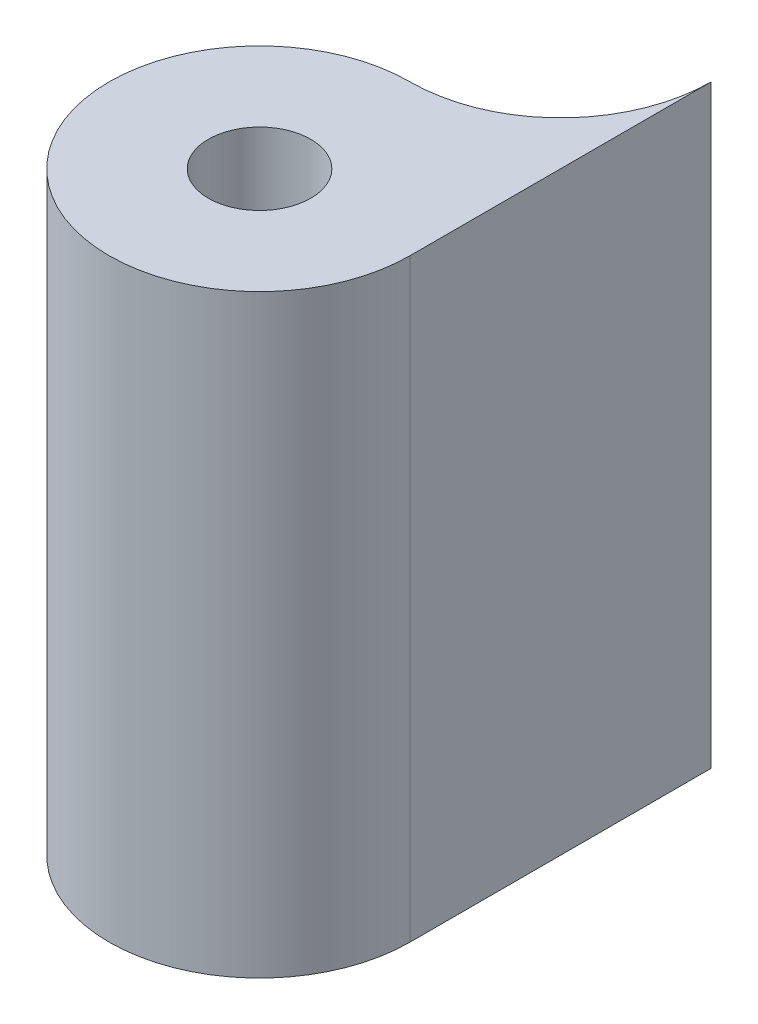
ISO-10303-21;
HEADER;
FILE_DESCRIPTION(('STEP AP214'),'2;1');
FILE_NAME('part.step','',(''),(''),'','','');
FILE_SCHEMA(('AUTOMOTIVE_DESIGN { 1 0 10303 214 1 1 1 1 }'));
ENDSEC;
DATA;
#1=APPLICATION_CONTEXT('core data for automotive mechanical design processes');
#2=APPLICATION_PROTOCOL_DEFINITION('international standard','automotive_design',2000,#1);
#3=PRODUCT_CONTEXT('',#1,'mechanical');
#4=PRODUCT('Part','Part','',(#3));
#5=PRODUCT_RELATED_PRODUCT_CATEGORY('part','',(#4));
#6=PRODUCT_DEFINITION_FORMATION('','',#4);
#7=PRODUCT_DEFINITION_CONTEXT('part definition',#1,'design');
#8=PRODUCT_DEFINITION('design','',#6,#7);
#9=PRODUCT_DEFINITION_SHAPE('','',#8);
#10=(LENGTH_UNIT() NAMED_UNIT(*) SI_UNIT(.MILLI.,.METRE.));
#11=(NAMED_UNIT(*) PLANE_ANGLE_UNIT() SI_UNIT($,.RADIAN.));
#12=(NAMED_UNIT(*) SI_UNIT($,.STERADIAN.) SOLID_ANGLE_UNIT());
#13=UNCERTAINTY_MEASURE_WITH_UNIT(LENGTH_MEASURE(1.E-05),#10,'distance_accuracy_value','');
#14=(GEOMETRIC_REPRESENTATION_CONTEXT(3) GLOBAL_UNCERTAINTY_ASSIGNED_CONTEXT((#13)) GLOBAL_UNIT_ASSIGNED_CONTEXT((#10,
#11,#12)) REPRESENTATION_CONTEXT('',''));
#15=CARTESIAN_POINT('',(0.,0.,0.));
#16=DIRECTION('',(0.,0.,1.));
#17=DIRECTION('',(1.,0.,0.));
#18=AXIS2_PLACEMENT_3D('',#15,#16,#17);
#19=CARTESIAN_POINT('',(-80.,32.5,20.));
#20=DIRECTION('',(0.,-1.,0.));
#21=DIRECTION('',(0.,0.,-1.));
#22=AXIS2_PLACEMENT_3D('',#19,#20,#21);
#23=CYLINDRICAL_SURFACE('',#22,1.7);
#24=CARTESIAN_POINT('',(-80.,12.75,20.));
#25=DIRECTION('',(0.,1.,0.));
#26=DIRECTION('',(0.,0.,1.));
#27=AXIS2_PLACEMENT_3D('',#24,#25,#26);
#28=CIRCLE('',#27,1.7);
#29=CARTESIAN_POINT('',(-80.,12.75,21.7));
#30=VERTEX_POINT('',#29);
#31=EDGE_CURVE('E96',#30,#30,#28,.T.);
#32=ORIENTED_EDGE('',*,*,#31,.F.);
#33=EDGE_LOOP('',(#32));
#34=FACE_BOUND('',#33,.T.);
#35=CARTESIAN_POINT('',(-80.,32.5,20.));
#36=DIRECTION('',(0.,1.,0.));
#37=DIRECTION('',(0.,0.,1.));
#38=AXIS2_PLACEMENT_3D('',#35,#36,#37);
#39=CIRCLE('',#38,1.7);
#40=CARTESIAN_POINT('',(-80.,32.5,21.7));
#41=VERTEX_POINT('',#40);
#42=EDGE_CURVE('E88',#41,#41,#39,.T.);
#43=ORIENTED_EDGE('',*,*,#42,.T.);
#44=EDGE_LOOP('',(#43));
#45=FACE_BOUND('',#44,.T.);
#46=ADVANCED_FACE('F35',(#34,#45),#23,.F.);
#47=CARTESIAN_POINT('',(-80.,12.75,9.99999999999999));
#48=DIRECTION('',(0.,1.,0.));
#49=DIRECTION('',(0.,0.,1.));
#50=AXIS2_PLACEMENT_3D('',#47,#48,#49);
#51=PLANE('',#50);
#52=ORIENTED_EDGE('',*,*,#31,.T.);
#53=EDGE_LOOP('',(#52));
#54=FACE_BOUND('',#53,.T.);
#55=DIRECTION('',(0.,0.,-1.));
#56=VECTOR('',#55,1.);
#57=CARTESIAN_POINT('',(-75.,12.75,9.99999999999999));
#58=LINE('',#57,#56);
#59=CARTESIAN_POINT('',(-75.,12.75,20.));
#60=VERTEX_POINT('',#59);
#61=CARTESIAN_POINT('',(-75.,12.75,9.99999999999999));
#62=VERTEX_POINT('',#61);
#63=EDGE_CURVE('E50',#60,#62,#58,.T.);
#64=ORIENTED_EDGE('',*,*,#63,.F.);
#65=CARTESIAN_POINT('',(-80.,12.75,20.));
#66=DIRECTION('',(0.,1.,0.));
#67=DIRECTION('',(0.,0.,1.));
#68=AXIS2_PLACEMENT_3D('',#65,#66,#67);
#69=CIRCLE('',#68,5.);
#70=CARTESIAN_POINT('',(-80.,12.75,15.));
#71=VERTEX_POINT('',#70);
#72=EDGE_CURVE('E84',#71,#60,#69,.T.);
#73=ORIENTED_EDGE('',*,*,#72,.F.);
#74=CARTESIAN_POINT('',(-80.,12.75,9.99999999999999));
#75=DIRECTION('',(0.,-1.,0.));
#76=DIRECTION('',(0.,0.,1.));
#77=AXIS2_PLACEMENT_3D('',#74,#75,#76);
#78=CIRCLE('',#77,5.);
#79=EDGE_CURVE('E93',#62,#71,#78,.T.);
#80=ORIENTED_EDGE('',*,*,#79,.F.);
#81=EDGE_LOOP('',(#64,#73,#80));
#82=FACE_BOUND('',#81,.T.);
#83=ADVANCED_FACE('F100',(#54,#82),#51,.F.);
#84=CARTESIAN_POINT('',(-80.,32.5,20.));
#85=DIRECTION('',(0.,-1.,0.));
#86=DIRECTION('',(0.,0.,-1.));
#87=AXIS2_PLACEMENT_3D('',#84,#85,#86);
#88=CYLINDRICAL_SURFACE('',#87,5.);
#89=DIRECTION('',(0.,-1.,0.));
#90=VECTOR('',#89,1.);
#91=CARTESIAN_POINT('',(-80.,32.5,15.));
#92=LINE('',#91,#90);
#93=CARTESIAN_POINT('',(-80.,32.5,15.));
#94=VERTEX_POINT('',#93);
#95=EDGE_CURVE('E11',#94,#71,#92,.T.);
#96=ORIENTED_EDGE('',*,*,#95,.T.);
#97=ORIENTED_EDGE('',*,*,#72,.T.);
#98=DIRECTION('',(0.,-1.,0.));
#99=VECTOR('',#98,1.);
#100=CARTESIAN_POINT('',(-75.,32.5,20.));
#101=LINE('',#100,#99);
#102=CARTESIAN_POINT('',(-75.,32.5,20.));
#103=VERTEX_POINT('',#102);
#104=EDGE_CURVE('E43',#103,#60,#101,.T.);
#105=ORIENTED_EDGE('',*,*,#104,.F.);
#106=CARTESIAN_POINT('',(-80.,32.5,20.));
#107=DIRECTION('',(0.,1.,0.));
#108=DIRECTION('',(0.,0.,1.));
#109=AXIS2_PLACEMENT_3D('',#106,#107,#108);
#110=CIRCLE('',#109,5.);
#111=EDGE_CURVE('E57',#94,#103,#110,.T.);
#112=ORIENTED_EDGE('',*,*,#111,.F.);
#113=EDGE_LOOP('',(#96,#97,#105,#112));
#114=FACE_BOUND('',#113,.T.);
#115=ADVANCED_FACE('F83',(#114),#88,.T.);
#116=CARTESIAN_POINT('',(-80.,32.5,9.99999999999999));
#117=DIRECTION('',(0.,-1.,0.));
#118=DIRECTION('',(0.,0.,-1.));
#119=AXIS2_PLACEMENT_3D('',#116,#117,#118);
#120=CYLINDRICAL_SURFACE('',#119,5.);
#121=DIRECTION('',(0.,-1.,0.));
#122=VECTOR('',#121,1.);
#123=CARTESIAN_POINT('',(-75.,32.5,9.99999999999999));
#124=LINE('',#123,#122);
#125=CARTESIAN_POINT('',(-75.,32.5,9.99999999999999));
#126=VERTEX_POINT('',#125);
#127=EDGE_CURVE('E74',#126,#62,#124,.T.);
#128=ORIENTED_EDGE('',*,*,#127,.T.);
#129=ORIENTED_EDGE('',*,*,#79,.T.);
#130=ORIENTED_EDGE('',*,*,#95,.F.);
#131=CARTESIAN_POINT('',(-80.,32.5,9.99999999999999));
#132=DIRECTION('',(0.,-1.,0.));
#133=DIRECTION('',(0.,0.,1.));
#134=AXIS2_PLACEMENT_3D('',#131,#132,#133);
#135=CIRCLE('',#134,5.);
#136=EDGE_CURVE('E80',#126,#94,#135,.T.);
#137=ORIENTED_EDGE('',*,*,#136,.F.);
#138=EDGE_LOOP('',(#128,#129,#130,#137));
#139=FACE_BOUND('',#138,.T.);
#140=ADVANCED_FACE('F37',(#139),#120,.F.);
#141=CARTESIAN_POINT('',(-80.,32.5,9.99999999999999));
#142=DIRECTION('',(0.,1.,0.));
#143=DIRECTION('',(0.,0.,1.));
#144=AXIS2_PLACEMENT_3D('',#141,#142,#143);
#145=PLANE('',#144);
#146=ORIENTED_EDGE('',*,*,#111,.T.);
#147=DIRECTION('',(0.,0.,-1.));
#148=VECTOR('',#147,1.);
#149=CARTESIAN_POINT('',(-75.,32.5,9.99999999999999));
#150=LINE('',#149,#148);
#151=EDGE_CURVE('E70',#103,#126,#150,.T.);
#152=ORIENTED_EDGE('',*,*,#151,.T.);
#153=ORIENTED_EDGE('',*,*,#136,.T.);
#154=EDGE_LOOP('',(#146,#152,#153));
#155=FACE_BOUND('',#154,.T.);
#156=ORIENTED_EDGE('',*,*,#42,.F.);
#157=EDGE_LOOP('',(#156));
#158=FACE_BOUND('',#157,.T.);
#159=ADVANCED_FACE('F78',(#155,#158),#145,.T.);
#160=CARTESIAN_POINT('',(-75.,0.,0.));
#161=DIRECTION('',(-1.,0.,0.));
#162=DIRECTION('',(0.,0.,1.));
#163=AXIS2_PLACEMENT_3D('',#160,#161,#162);
#164=PLANE('',#163);
#165=ORIENTED_EDGE('',*,*,#127,.F.);
#166=ORIENTED_EDGE('',*,*,#151,.F.);
#167=ORIENTED_EDGE('',*,*,#104,.T.);
#168=ORIENTED_EDGE('',*,*,#63,.T.);
#169=EDGE_LOOP('',(#165,#166,#167,#168));
#170=FACE_BOUND('',#169,.T.);
#171=ADVANCED_FACE('F71',(#170),#164,.F.);
#172=CLOSED_SHELL('',(#46,#83,#115,#140,#159,#171));
#173=MANIFOLD_SOLID_BREP('B2',#172);
#174=ADVANCED_BREP_SHAPE_REPRESENTATION('',(#18,#173),#14);
#175=SHAPE_DEFINITION_REPRESENTATION(#9,#174);
ENDSEC;
END-ISO-10303-21;
